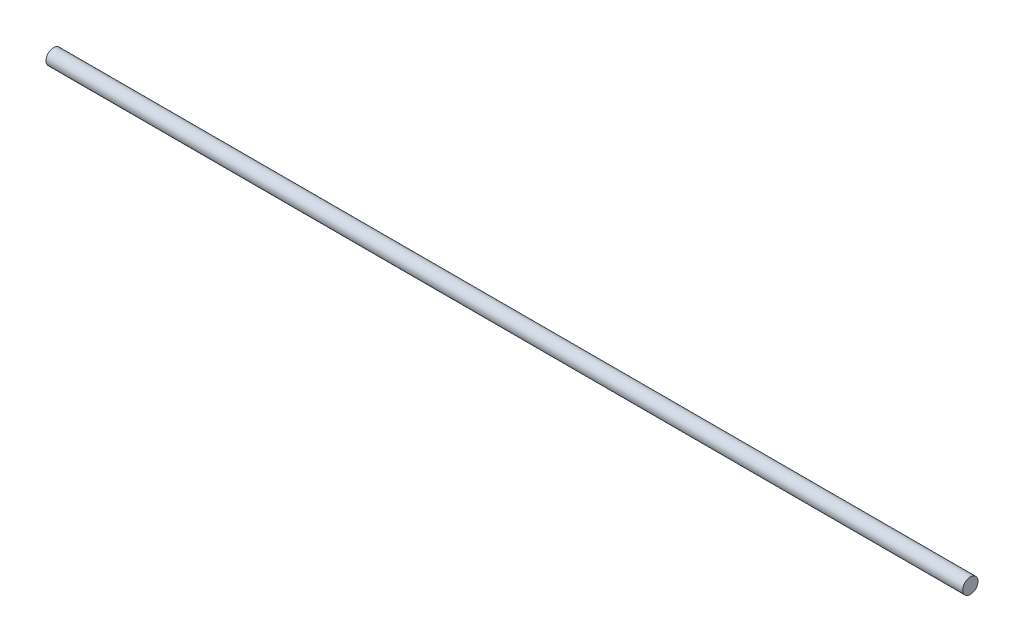
ISO-10303-21;
HEADER;
FILE_DESCRIPTION(('STEP AP214'),'2;1');
FILE_NAME('part.step','',(''),(''),'','','');
FILE_SCHEMA(('AUTOMOTIVE_DESIGN { 1 0 10303 214 1 1 1 1 }'));
ENDSEC;
DATA;
#1=APPLICATION_CONTEXT('core data for automotive mechanical design processes');
#2=APPLICATION_PROTOCOL_DEFINITION('international standard','automotive_design',2000,#1);
#3=PRODUCT_CONTEXT('',#1,'mechanical');
#4=PRODUCT('Part','Part','',(#3));
#5=PRODUCT_RELATED_PRODUCT_CATEGORY('part','',(#4));
#6=PRODUCT_DEFINITION_FORMATION('','',#4);
#7=PRODUCT_DEFINITION_CONTEXT('part definition',#1,'design');
#8=PRODUCT_DEFINITION('design','',#6,#7);
#9=PRODUCT_DEFINITION_SHAPE('','',#8);
#10=(LENGTH_UNIT() NAMED_UNIT(*) SI_UNIT(.MILLI.,.METRE.));
#11=(NAMED_UNIT(*) PLANE_ANGLE_UNIT() SI_UNIT($,.RADIAN.));
#12=(NAMED_UNIT(*) SI_UNIT($,.STERADIAN.) SOLID_ANGLE_UNIT());
#13=UNCERTAINTY_MEASURE_WITH_UNIT(LENGTH_MEASURE(1.E-05),#10,'distance_accuracy_value','');
#14=(GEOMETRIC_REPRESENTATION_CONTEXT(3) GLOBAL_UNCERTAINTY_ASSIGNED_CONTEXT((#13)) GLOBAL_UNIT_ASSIGNED_CONTEXT((#10,
#11,#12)) REPRESENTATION_CONTEXT('',''));
#15=CARTESIAN_POINT('',(0.,0.,0.));
#16=DIRECTION('',(0.,0.,1.));
#17=DIRECTION('',(1.,0.,0.));
#18=AXIS2_PLACEMENT_3D('',#15,#16,#17);
#19=CARTESIAN_POINT('',(762.,0.,0.));
#20=DIRECTION('',(-1.,0.,0.));
#21=DIRECTION('',(0.,0.,1.));
#22=AXIS2_PLACEMENT_3D('',#19,#20,#21);
#23=CYLINDRICAL_SURFACE('',#22,6.35);
#24=CARTESIAN_POINT('',(762.,0.,0.));
#25=DIRECTION('',(1.,0.,0.));
#26=DIRECTION('',(0.,0.,-1.));
#27=AXIS2_PLACEMENT_3D('',#24,#25,#26);
#28=CIRCLE('',#27,6.35);
#29=CARTESIAN_POINT('',(762.,0.,-6.35));
#30=VERTEX_POINT('',#29);
#31=EDGE_CURVE('E10',#30,#30,#28,.T.);
#32=ORIENTED_EDGE('',*,*,#31,.F.);
#33=EDGE_LOOP('',(#32));
#34=FACE_BOUND('',#33,.T.);
#35=CARTESIAN_POINT('',(0.,0.,0.));
#36=DIRECTION('',(1.,0.,0.));
#37=DIRECTION('',(0.,0.,-1.));
#38=AXIS2_PLACEMENT_3D('',#35,#36,#37);
#39=CIRCLE('',#38,6.35);
#40=CARTESIAN_POINT('',(0.,0.,-6.35));
#41=VERTEX_POINT('',#40);
#42=EDGE_CURVE('E34',#41,#41,#39,.T.);
#43=ORIENTED_EDGE('',*,*,#42,.T.);
#44=EDGE_LOOP('',(#43));
#45=FACE_BOUND('',#44,.T.);
#46=ADVANCED_FACE('F31',(#34,#45),#23,.T.);
#47=CARTESIAN_POINT('',(762.,0.,0.));
#48=DIRECTION('',(1.,0.,0.));
#49=DIRECTION('',(0.,0.,-1.));
#50=AXIS2_PLACEMENT_3D('',#47,#48,#49);
#51=PLANE('',#50);
#52=ORIENTED_EDGE('',*,*,#31,.T.);
#53=EDGE_LOOP('',(#52));
#54=FACE_BOUND('',#53,.T.);
#55=ADVANCED_FACE('F46',(#54),#51,.T.);
#56=CARTESIAN_POINT('',(0.,0.,0.));
#57=DIRECTION('',(1.,0.,0.));
#58=DIRECTION('',(0.,0.,-1.));
#59=AXIS2_PLACEMENT_3D('',#56,#57,#58);
#60=PLANE('',#59);
#61=ORIENTED_EDGE('',*,*,#42,.F.);
#62=EDGE_LOOP('',(#61));
#63=FACE_BOUND('',#62,.T.);
#64=ADVANCED_FACE('F44',(#63),#60,.F.);
#65=CLOSED_SHELL('',(#46,#55,#64));
#66=MANIFOLD_SOLID_BREP('B2',#65);
#67=ADVANCED_BREP_SHAPE_REPRESENTATION('',(#18,#66),#14);
#68=SHAPE_DEFINITION_REPRESENTATION(#9,#67);
ENDSEC;
END-ISO-10303-21;
